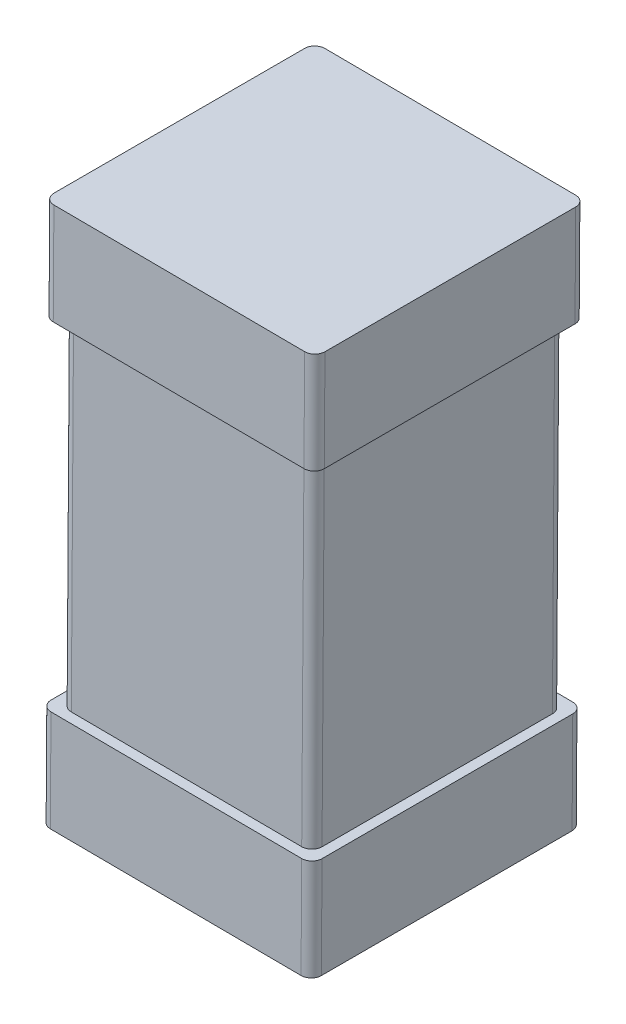
ISO-10303-21;
HEADER;
FILE_DESCRIPTION(('STEP AP214'),'2;1');
FILE_NAME('part.step','',(''),(''),'','','');
FILE_SCHEMA(('AUTOMOTIVE_DESIGN { 1 0 10303 214 1 1 1 1 }'));
ENDSEC;
DATA;
#1=APPLICATION_CONTEXT('core data for automotive mechanical design processes');
#2=APPLICATION_PROTOCOL_DEFINITION('international standard','automotive_design',2000,#1);
#3=PRODUCT_CONTEXT('',#1,'mechanical');
#4=PRODUCT('Part','Part','',(#3));
#5=PRODUCT_RELATED_PRODUCT_CATEGORY('part','',(#4));
#6=PRODUCT_DEFINITION_FORMATION('','',#4);
#7=PRODUCT_DEFINITION_CONTEXT('part definition',#1,'design');
#8=PRODUCT_DEFINITION('design','',#6,#7);
#9=PRODUCT_DEFINITION_SHAPE('','',#8);
#10=(LENGTH_UNIT() NAMED_UNIT(*) SI_UNIT(.MILLI.,.METRE.));
#11=(NAMED_UNIT(*) PLANE_ANGLE_UNIT() SI_UNIT($,.RADIAN.));
#12=(NAMED_UNIT(*) SI_UNIT($,.STERADIAN.) SOLID_ANGLE_UNIT());
#13=UNCERTAINTY_MEASURE_WITH_UNIT(LENGTH_MEASURE(1.E-05),#10,'distance_accuracy_value','');
#14=(GEOMETRIC_REPRESENTATION_CONTEXT(3) GLOBAL_UNCERTAINTY_ASSIGNED_CONTEXT((#13)) GLOBAL_UNIT_ASSIGNED_CONTEXT((#10,
#11,#12)) REPRESENTATION_CONTEXT('',''));
#15=CARTESIAN_POINT('',(0.,0.,0.));
#16=DIRECTION('',(0.,0.,1.));
#17=DIRECTION('',(1.,0.,0.));
#18=AXIS2_PLACEMENT_3D('',#15,#16,#17);
#19=CARTESIAN_POINT('',(194.689513142969,110.245792753851,142.211582908599));
#20=DIRECTION('',(0.00663069374923689,0.99997801670857,0.));
#21=DIRECTION('',(0.,0.,-1.));
#22=AXIS2_PLACEMENT_3D('',#19,#20,#21);
#23=PLANE('',#22);
#24=DIRECTION('',(0.,0.,1.));
#25=VECTOR('',#24,1.);
#26=CARTESIAN_POINT('',(194.689513142969,110.245792753851,142.211582908599));
#27=LINE('',#26,#25);
#28=CARTESIAN_POINT('',(194.689513142969,110.245792753851,142.241582908599));
#29=VERTEX_POINT('',#28);
#30=CARTESIAN_POINT('',(194.689513142969,110.245792753851,142.981582908599));
#31=VERTEX_POINT('',#30);
#32=EDGE_CURVE('E67',#29,#31,#27,.T.);
#33=ORIENTED_EDGE('',*,*,#32,.F.);
#34=CARTESIAN_POINT('',(194.659513802468,110.245991674664,142.241582908599));
#35=DIRECTION('',(0.00663069374923689,0.99997801670857,0.));
#36=DIRECTION('',(0.,0.,1.));
#37=AXIS2_PLACEMENT_3D('',#34,#35,#36);
#38=CIRCLE('',#37,0.0300000000000023);
#39=CARTESIAN_POINT('',(194.659513802468,110.245991674664,142.211582908599));
#40=VERTEX_POINT('',#39);
#41=EDGE_CURVE('E11',#29,#40,#38,.T.);
#42=ORIENTED_EDGE('',*,*,#41,.T.);
#43=DIRECTION('',(-0.999978016708569,0.00663069374923689,0.));
#44=VECTOR('',#43,1.);
#45=CARTESIAN_POINT('',(194.689513142969,110.245792753851,142.211582908599));
#46=LINE('',#45,#44);
#47=CARTESIAN_POINT('',(193.919530070103,110.250898388038,142.211582908599));
#48=VERTEX_POINT('',#47);
#49=EDGE_CURVE('E55',#40,#48,#46,.T.);
#50=ORIENTED_EDGE('',*,*,#49,.T.);
#51=CARTESIAN_POINT('',(193.919530070103,110.250898388038,142.241582908599));
#52=DIRECTION('',(-0.00663069374923689,-0.99997801670857,0.));
#53=DIRECTION('',(0.,0.,1.));
#54=AXIS2_PLACEMENT_3D('',#51,#52,#53);
#55=CIRCLE('',#54,0.0300000000000023);
#56=CARTESIAN_POINT('',(193.889530729602,110.251097308851,142.241582908599));
#57=VERTEX_POINT('',#56);
#58=EDGE_CURVE('E288',#57,#48,#55,.T.);
#59=ORIENTED_EDGE('',*,*,#58,.F.);
#60=DIRECTION('',(0.,0.,1.));
#61=VECTOR('',#60,1.);
#62=CARTESIAN_POINT('',(193.889530729602,110.251097308851,142.211582908599));
#63=LINE('',#62,#61);
#64=CARTESIAN_POINT('',(193.889530729602,110.251097308851,142.981582908599));
#65=VERTEX_POINT('',#64);
#66=EDGE_CURVE('E268',#57,#65,#63,.T.);
#67=ORIENTED_EDGE('',*,*,#66,.T.);
#68=CARTESIAN_POINT('',(193.919530070103,110.250898388038,142.981582908599));
#69=DIRECTION('',(0.00663069374923689,0.99997801670857,0.));
#70=DIRECTION('',(0.,0.,1.));
#71=AXIS2_PLACEMENT_3D('',#68,#69,#70);
#72=CIRCLE('',#71,0.0300000000000023);
#73=CARTESIAN_POINT('',(193.919530070103,110.250898388038,143.011582908599));
#74=VERTEX_POINT('',#73);
#75=EDGE_CURVE('E266',#65,#74,#72,.T.);
#76=ORIENTED_EDGE('',*,*,#75,.T.);
#77=DIRECTION('',(-0.999978016708569,0.00663069374923689,0.));
#78=VECTOR('',#77,1.);
#79=CARTESIAN_POINT('',(194.689513142969,110.245792753851,143.011582908599));
#80=LINE('',#79,#78);
#81=CARTESIAN_POINT('',(194.659513802468,110.245991674664,143.011582908599));
#82=VERTEX_POINT('',#81);
#83=EDGE_CURVE('E254',#82,#74,#80,.T.);
#84=ORIENTED_EDGE('',*,*,#83,.F.);
#85=CARTESIAN_POINT('',(194.659513802468,110.245991674664,142.981582908599));
#86=DIRECTION('',(-0.00663069374923689,-0.99997801670857,0.));
#87=DIRECTION('',(0.,0.,1.));
#88=AXIS2_PLACEMENT_3D('',#85,#86,#87);
#89=CIRCLE('',#88,0.0300000000000023);
#90=EDGE_CURVE('E336',#31,#82,#89,.T.);
#91=ORIENTED_EDGE('',*,*,#90,.F.);
#92=EDGE_LOOP('',(#33,#42,#50,#59,#67,#76,#84,#91));
#93=FACE_BOUND('',#92,.T.);
#94=ADVANCED_FACE('F44',(#93),#23,.T.);
#95=CARTESIAN_POINT('',(193.887541521477,109.951103903838,142.211582908599));
#96=DIRECTION('',(-0.99997801670857,0.00663069374923689,0.));
#97=DIRECTION('',(0.,0.,1.));
#98=AXIS2_PLACEMENT_3D('',#95,#96,#97);
#99=PLANE('',#98);
#100=ORIENTED_EDGE('',*,*,#66,.F.);
#101=DIRECTION('',(0.00663069374923689,0.999978016708569,0.));
#102=VECTOR('',#101,1.);
#103=CARTESIAN_POINT('',(193.887541521477,109.951103903838,142.241582908599));
#104=LINE('',#103,#102);
#105=CARTESIAN_POINT('',(193.887541521477,109.951103903838,142.241582908599));
#106=VERTEX_POINT('',#105);
#107=EDGE_CURVE('E279',#106,#57,#104,.T.);
#108=ORIENTED_EDGE('',*,*,#107,.F.);
#109=DIRECTION('',(0.,0.,1.));
#110=VECTOR('',#109,1.);
#111=CARTESIAN_POINT('',(193.887541521477,109.951103903838,142.211582908599));
#112=LINE('',#111,#110);
#113=CARTESIAN_POINT('',(193.887541521477,109.951103903838,142.981582908599));
#114=VERTEX_POINT('',#113);
#115=EDGE_CURVE('E272',#106,#114,#112,.T.);
#116=ORIENTED_EDGE('',*,*,#115,.T.);
#117=DIRECTION('',(0.00663069374923689,0.999978016708569,0.));
#118=VECTOR('',#117,1.);
#119=CARTESIAN_POINT('',(193.887541521477,109.951103903838,142.981582908599));
#120=LINE('',#119,#118);
#121=EDGE_CURVE('E284',#114,#65,#120,.T.);
#122=ORIENTED_EDGE('',*,*,#121,.T.);
#123=EDGE_LOOP('',(#100,#108,#116,#122));
#124=FACE_BOUND('',#123,.T.);
#125=ADVANCED_FACE('F567',(#124),#99,.T.);
#126=CARTESIAN_POINT('',(193.917540861979,109.950904983026,142.981582908599));
#127=DIRECTION('',(0.00663069374915559,0.99997801670857,0.));
#128=DIRECTION('',(-0.99997801670857,0.00663069374915559,0.));
#129=AXIS2_PLACEMENT_3D('',#126,#127,#128);
#130=CYLINDRICAL_SURFACE('',#129,0.0300000000000117);
#131=CARTESIAN_POINT('',(193.917540861979,109.950904983026,142.981582908599));
#132=DIRECTION('',(0.00663069374923689,0.99997801670857,0.));
#133=DIRECTION('',(0.,0.,1.));
#134=AXIS2_PLACEMENT_3D('',#131,#132,#133);
#135=CIRCLE('',#134,0.0300000000000023);
#136=CARTESIAN_POINT('',(193.917540861979,109.950904983026,143.011582908599));
#137=VERTEX_POINT('',#136);
#138=EDGE_CURVE('E276',#114,#137,#135,.T.);
#139=ORIENTED_EDGE('',*,*,#138,.T.);
#140=DIRECTION('',(0.00663069374923689,0.999978016708569,0.));
#141=VECTOR('',#140,1.);
#142=CARTESIAN_POINT('',(193.917540861979,109.950904983026,143.011582908599));
#143=LINE('',#142,#141);
#144=EDGE_CURVE('E258',#137,#74,#143,.T.);
#145=ORIENTED_EDGE('',*,*,#144,.T.);
#146=ORIENTED_EDGE('',*,*,#75,.F.);
#147=ORIENTED_EDGE('',*,*,#121,.F.);
#148=EDGE_LOOP('',(#139,#145,#146,#147));
#149=FACE_BOUND('',#148,.T.);
#150=ADVANCED_FACE('F274',(#149),#130,.T.);
#151=CARTESIAN_POINT('',(193.917540861979,109.950904983026,142.241582908599));
#152=DIRECTION('',(0.00663069374915559,0.99997801670857,0.));
#153=DIRECTION('',(-0.99997801670857,0.00663069374915559,0.));
#154=AXIS2_PLACEMENT_3D('',#151,#152,#153);
#155=CYLINDRICAL_SURFACE('',#154,0.0300000000000117);
#156=ORIENTED_EDGE('',*,*,#107,.T.);
#157=ORIENTED_EDGE('',*,*,#58,.T.);
#158=DIRECTION('',(0.00663069374923689,0.999978016708569,0.));
#159=VECTOR('',#158,1.);
#160=CARTESIAN_POINT('',(193.917540861979,109.950904983026,142.211582908599));
#161=LINE('',#160,#159);
#162=CARTESIAN_POINT('',(193.917540861979,109.950904983026,142.211582908599));
#163=VERTEX_POINT('',#162);
#164=EDGE_CURVE('E263',#163,#48,#161,.T.);
#165=ORIENTED_EDGE('',*,*,#164,.F.);
#166=CARTESIAN_POINT('',(193.917540861979,109.950904983026,142.241582908599));
#167=DIRECTION('',(-0.00663069374923689,-0.99997801670857,0.));
#168=DIRECTION('',(0.,0.,1.));
#169=AXIS2_PLACEMENT_3D('',#166,#167,#168);
#170=CIRCLE('',#169,0.0300000000000023);
#171=EDGE_CURVE('E298',#106,#163,#170,.T.);
#172=ORIENTED_EDGE('',*,*,#171,.F.);
#173=EDGE_LOOP('',(#156,#157,#165,#172));
#174=FACE_BOUND('',#173,.T.);
#175=ADVANCED_FACE('F580',(#174),#155,.T.);
#176=CARTESIAN_POINT('',(194.687523934844,109.945799348839,143.011582908599));
#177=DIRECTION('',(0.,0.,1.));
#178=DIRECTION('',(1.,0.,0.));
#179=AXIS2_PLACEMENT_3D('',#176,#177,#178);
#180=PLANE('',#179);
#181=DIRECTION('',(-0.999978016708569,0.00663069374923689,0.));
#182=VECTOR('',#181,1.);
#183=CARTESIAN_POINT('',(194.687523934844,109.945799348839,143.011582908599));
#184=LINE('',#183,#182);
#185=CARTESIAN_POINT('',(194.657524594343,109.945998269651,143.011582908599));
#186=VERTEX_POINT('',#185);
#187=EDGE_CURVE('E345',#186,#137,#184,.T.);
#188=ORIENTED_EDGE('',*,*,#187,.F.);
#189=DIRECTION('',(0.00663069374923689,0.999978016708569,0.));
#190=VECTOR('',#189,1.);
#191=CARTESIAN_POINT('',(194.657524594343,109.945998269651,143.011582908599));
#192=LINE('',#191,#190);
#193=EDGE_CURVE('E261',#186,#82,#192,.T.);
#194=ORIENTED_EDGE('',*,*,#193,.T.);
#195=ORIENTED_EDGE('',*,*,#83,.T.);
#196=ORIENTED_EDGE('',*,*,#144,.F.);
#197=EDGE_LOOP('',(#188,#194,#195,#196));
#198=FACE_BOUND('',#197,.T.);
#199=ADVANCED_FACE('F256',(#198),#180,.T.);
#200=CARTESIAN_POINT('',(194.687523934844,109.945799348839,142.211582908599));
#201=DIRECTION('',(0.,0.,1.));
#202=DIRECTION('',(1.,0.,0.));
#203=AXIS2_PLACEMENT_3D('',#200,#201,#202);
#204=PLANE('',#203);
#205=ORIENTED_EDGE('',*,*,#164,.T.);
#206=ORIENTED_EDGE('',*,*,#49,.F.);
#207=DIRECTION('',(0.00663069374923689,0.999978016708569,0.));
#208=VECTOR('',#207,1.);
#209=CARTESIAN_POINT('',(194.657524594343,109.945998269651,142.211582908599));
#210=LINE('',#209,#208);
#211=CARTESIAN_POINT('',(194.657524594343,109.945998269651,142.211582908599));
#212=VERTEX_POINT('',#211);
#213=EDGE_CURVE('E419',#212,#40,#210,.T.);
#214=ORIENTED_EDGE('',*,*,#213,.F.);
#215=DIRECTION('',(-0.999978016708569,0.00663069374923689,0.));
#216=VECTOR('',#215,1.);
#217=CARTESIAN_POINT('',(194.687523934844,109.945799348839,142.211582908599));
#218=LINE('',#217,#216);
#219=EDGE_CURVE('E423',#212,#163,#218,.T.);
#220=ORIENTED_EDGE('',*,*,#219,.T.);
#221=EDGE_LOOP('',(#205,#206,#214,#220));
#222=FACE_BOUND('',#221,.T.);
#223=ADVANCED_FACE('F584',(#222),#204,.F.);
#224=CARTESIAN_POINT('',(194.657524594343,109.945998269651,142.981582908599));
#225=DIRECTION('',(0.00663069374915559,0.99997801670857,0.));
#226=DIRECTION('',(0.99997801670857,-0.00663069374915559,0.));
#227=AXIS2_PLACEMENT_3D('',#224,#225,#226);
#228=CYLINDRICAL_SURFACE('',#227,0.0300000000000117);
#229=DIRECTION('',(0.00663069374923689,0.999978016708569,0.));
#230=VECTOR('',#229,1.);
#231=CARTESIAN_POINT('',(194.687523934844,109.945799348839,142.981582908599));
#232=LINE('',#231,#230);
#233=CARTESIAN_POINT('',(194.687523934844,109.945799348839,142.981582908599));
#234=VERTEX_POINT('',#233);
#235=EDGE_CURVE('E339',#234,#31,#232,.T.);
#236=ORIENTED_EDGE('',*,*,#235,.T.);
#237=ORIENTED_EDGE('',*,*,#90,.T.);
#238=ORIENTED_EDGE('',*,*,#193,.F.);
#239=CARTESIAN_POINT('',(194.657524594343,109.945998269651,142.981582908599));
#240=DIRECTION('',(-0.00663069374923689,-0.99997801670857,0.));
#241=DIRECTION('',(0.,0.,1.));
#242=AXIS2_PLACEMENT_3D('',#239,#240,#241);
#243=CIRCLE('',#242,0.0300000000000023);
#244=EDGE_CURVE('E341',#234,#186,#243,.T.);
#245=ORIENTED_EDGE('',*,*,#244,.F.);
#246=EDGE_LOOP('',(#236,#237,#238,#245));
#247=FACE_BOUND('',#246,.T.);
#248=ADVANCED_FACE('F587',(#247),#228,.T.);
#249=CARTESIAN_POINT('',(194.657524594343,109.945998269651,142.241582908599));
#250=DIRECTION('',(0.00663069374915559,0.99997801670857,0.));
#251=DIRECTION('',(0.99997801670857,-0.00663069374915559,0.));
#252=AXIS2_PLACEMENT_3D('',#249,#250,#251);
#253=CYLINDRICAL_SURFACE('',#252,0.0300000000000117);
#254=CARTESIAN_POINT('',(194.657524594343,109.945998269651,142.241582908599));
#255=DIRECTION('',(0.00663069374923689,0.99997801670857,0.));
#256=DIRECTION('',(0.,0.,1.));
#257=AXIS2_PLACEMENT_3D('',#254,#255,#256);
#258=CIRCLE('',#257,0.0300000000000023);
#259=CARTESIAN_POINT('',(194.687523934844,109.945799348839,142.241582908599));
#260=VERTEX_POINT('',#259);
#261=EDGE_CURVE('E340',#260,#212,#258,.T.);
#262=ORIENTED_EDGE('',*,*,#261,.T.);
#263=ORIENTED_EDGE('',*,*,#213,.T.);
#264=ORIENTED_EDGE('',*,*,#41,.F.);
#265=DIRECTION('',(0.00663069374923689,0.999978016708569,0.));
#266=VECTOR('',#265,1.);
#267=CARTESIAN_POINT('',(194.687523934844,109.945799348839,142.241582908599));
#268=LINE('',#267,#266);
#269=EDGE_CURVE('E436',#260,#29,#268,.T.);
#270=ORIENTED_EDGE('',*,*,#269,.F.);
#271=EDGE_LOOP('',(#262,#263,#264,#270));
#272=FACE_BOUND('',#271,.T.);
#273=ADVANCED_FACE('F649',(#272),#253,.T.);
#274=CARTESIAN_POINT('',(194.687523934844,109.945799348839,142.211582908599));
#275=DIRECTION('',(-0.99997801670857,0.00663069374923689,0.));
#276=DIRECTION('',(0.,0.,1.));
#277=AXIS2_PLACEMENT_3D('',#274,#275,#276);
#278=PLANE('',#277);
#279=ORIENTED_EDGE('',*,*,#235,.F.);
#280=DIRECTION('',(0.,0.,1.));
#281=VECTOR('',#280,1.);
#282=CARTESIAN_POINT('',(194.687523934844,109.945799348839,142.211582908599));
#283=LINE('',#282,#281);
#284=EDGE_CURVE('E294',#260,#234,#283,.T.);
#285=ORIENTED_EDGE('',*,*,#284,.F.);
#286=ORIENTED_EDGE('',*,*,#269,.T.);
#287=ORIENTED_EDGE('',*,*,#32,.T.);
#288=EDGE_LOOP('',(#279,#285,#286,#287));
#289=FACE_BOUND('',#288,.T.);
#290=ADVANCED_FACE('F652',(#289),#278,.F.);
#291=CARTESIAN_POINT('',(194.687523934844,109.945799348839,142.211582908599));
#292=DIRECTION('',(0.00663069374923689,0.99997801670857,0.));
#293=DIRECTION('',(0.,0.,-1.));
#294=AXIS2_PLACEMENT_3D('',#291,#292,#293);
#295=PLANE('',#294);
#296=ORIENTED_EDGE('',*,*,#244,.T.);
#297=ORIENTED_EDGE('',*,*,#187,.T.);
#298=ORIENTED_EDGE('',*,*,#138,.F.);
#299=ORIENTED_EDGE('',*,*,#115,.F.);
#300=ORIENTED_EDGE('',*,*,#171,.T.);
#301=ORIENTED_EDGE('',*,*,#219,.F.);
#302=ORIENTED_EDGE('',*,*,#261,.F.);
#303=ORIENTED_EDGE('',*,*,#284,.T.);
#304=EDGE_LOOP('',(#296,#297,#298,#299,#300,#301,#302,#303));
#305=FACE_BOUND('',#304,.T.);
#306=DIRECTION('',(-0.999978016708569,0.00663069374923689,0.));
#307=VECTOR('',#306,1.);
#308=CARTESIAN_POINT('',(194.657524594343,109.945998269651,142.241582908599));
#309=LINE('',#308,#307);
#310=CARTESIAN_POINT('',(194.627525253841,109.946197190464,142.241582908599));
#311=VERTEX_POINT('',#310);
#312=CARTESIAN_POINT('',(193.947540202479,109.950706062213,142.241582908599));
#313=VERTEX_POINT('',#312);
#314=EDGE_CURVE('E299',#311,#313,#309,.T.);
#315=ORIENTED_EDGE('',*,*,#314,.T.);
#316=CARTESIAN_POINT('',(193.947540202479,109.950706062213,142.271582908599));
#317=DIRECTION('',(-0.00663069374923689,-0.99997801670857,0.));
#318=DIRECTION('',(0.,0.,1.));
#319=AXIS2_PLACEMENT_3D('',#316,#317,#318);
#320=CIRCLE('',#319,0.0300000000000023);
#321=CARTESIAN_POINT('',(193.917540861979,109.950904983026,142.271582908599));
#322=VERTEX_POINT('',#321);
#323=EDGE_CURVE('E351',#322,#313,#320,.T.);
#324=ORIENTED_EDGE('',*,*,#323,.F.);
#325=DIRECTION('',(0.,0.,1.));
#326=VECTOR('',#325,1.);
#327=CARTESIAN_POINT('',(193.917540861979,109.950904983026,142.241582908599));
#328=LINE('',#327,#326);
#329=CARTESIAN_POINT('',(193.917540861979,109.950904983026,142.951582908599));
#330=VERTEX_POINT('',#329);
#331=EDGE_CURVE('E303',#322,#330,#328,.T.);
#332=ORIENTED_EDGE('',*,*,#331,.T.);
#333=CARTESIAN_POINT('',(193.947540202479,109.950706062213,142.951582908599));
#334=DIRECTION('',(0.00663069374923689,0.99997801670857,0.));
#335=DIRECTION('',(0.,0.,1.));
#336=AXIS2_PLACEMENT_3D('',#333,#334,#335);
#337=CIRCLE('',#336,0.0300000000000023);
#338=CARTESIAN_POINT('',(193.947540202479,109.950706062213,142.981582908599));
#339=VERTEX_POINT('',#338);
#340=EDGE_CURVE('E487',#330,#339,#337,.T.);
#341=ORIENTED_EDGE('',*,*,#340,.T.);
#342=DIRECTION('',(-0.999978016708569,0.00663069374923689,0.));
#343=VECTOR('',#342,1.);
#344=CARTESIAN_POINT('',(194.657524594343,109.945998269651,142.981582908599));
#345=LINE('',#344,#343);
#346=CARTESIAN_POINT('',(194.627525253841,109.946197190464,142.981582908599));
#347=VERTEX_POINT('',#346);
#348=EDGE_CURVE('E403',#347,#339,#345,.T.);
#349=ORIENTED_EDGE('',*,*,#348,.F.);
#350=CARTESIAN_POINT('',(194.627525253841,109.946197190464,142.951582908599));
#351=DIRECTION('',(-0.00663069374923689,-0.99997801670857,0.));
#352=DIRECTION('',(0.,0.,1.));
#353=AXIS2_PLACEMENT_3D('',#350,#351,#352);
#354=CIRCLE('',#353,0.0300000000000023);
#355=CARTESIAN_POINT('',(194.657524594343,109.945998269651,142.951582908599));
#356=VERTEX_POINT('',#355);
#357=EDGE_CURVE('E363',#356,#347,#354,.T.);
#358=ORIENTED_EDGE('',*,*,#357,.F.);
#359=DIRECTION('',(0.,0.,1.));
#360=VECTOR('',#359,1.);
#361=CARTESIAN_POINT('',(194.657524594343,109.945998269651,142.241582908599));
#362=LINE('',#361,#360);
#363=CARTESIAN_POINT('',(194.657524594343,109.945998269651,142.271582908599));
#364=VERTEX_POINT('',#363);
#365=EDGE_CURVE('E427',#364,#356,#362,.T.);
#366=ORIENTED_EDGE('',*,*,#365,.F.);
#367=CARTESIAN_POINT('',(194.627525253841,109.946197190464,142.271582908599));
#368=DIRECTION('',(0.00663069374923689,0.99997801670857,0.));
#369=DIRECTION('',(0.,0.,1.));
#370=AXIS2_PLACEMENT_3D('',#367,#368,#369);
#371=CIRCLE('',#370,0.0300000000000023);
#372=EDGE_CURVE('E48',#364,#311,#371,.T.);
#373=ORIENTED_EDGE('',*,*,#372,.T.);
#374=EDGE_LOOP('',(#315,#324,#332,#341,#349,#358,#366,#373));
#375=FACE_BOUND('',#374,.T.);
#376=ADVANCED_FACE('F545',(#305,#375),#295,.F.);
#377=CARTESIAN_POINT('',(194.650893900594,108.946020252943,142.241582908599));
#378=DIRECTION('',(-0.99997801670857,0.00663069374923689,0.));
#379=DIRECTION('',(0.,0.,1.));
#380=AXIS2_PLACEMENT_3D('',#377,#378,#379);
#381=PLANE('',#380);
#382=DIRECTION('',(0.00663069374923689,0.999978016708569,0.));
#383=VECTOR('',#382,1.);
#384=CARTESIAN_POINT('',(194.650893900594,108.946020252943,142.951582908599));
#385=LINE('',#384,#383);
#386=CARTESIAN_POINT('',(194.650893900594,108.946020252943,142.951582908599));
#387=VERTEX_POINT('',#386);
#388=EDGE_CURVE('E367',#387,#356,#385,.T.);
#389=ORIENTED_EDGE('',*,*,#388,.F.);
#390=DIRECTION('',(0.,0.,1.));
#391=VECTOR('',#390,1.);
#392=CARTESIAN_POINT('',(194.650893900594,108.946020252943,142.241582908599));
#393=LINE('',#392,#391);
#394=CARTESIAN_POINT('',(194.650893900594,108.946020252943,142.271582908599));
#395=VERTEX_POINT('',#394);
#396=EDGE_CURVE('E393',#395,#387,#393,.T.);
#397=ORIENTED_EDGE('',*,*,#396,.F.);
#398=DIRECTION('',(0.00663069374923689,0.999978016708569,0.));
#399=VECTOR('',#398,1.);
#400=CARTESIAN_POINT('',(194.650893900594,108.946020252943,142.271582908599));
#401=LINE('',#400,#399);
#402=EDGE_CURVE('E431',#395,#364,#401,.T.);
#403=ORIENTED_EDGE('',*,*,#402,.T.);
#404=ORIENTED_EDGE('',*,*,#365,.T.);
#405=EDGE_LOOP('',(#389,#397,#403,#404));
#406=FACE_BOUND('',#405,.T.);
#407=ADVANCED_FACE('F543',(#406),#381,.F.);
#408=CARTESIAN_POINT('',(194.620894560092,108.946219173755,142.951582908599));
#409=DIRECTION('',(0.00663069374915559,0.99997801670857,0.));
#410=DIRECTION('',(0.99997801670857,-0.00663069374915559,0.));
#411=AXIS2_PLACEMENT_3D('',#408,#409,#410);
#412=CYLINDRICAL_SURFACE('',#411,0.0300000000000117);
#413=ORIENTED_EDGE('',*,*,#388,.T.);
#414=ORIENTED_EDGE('',*,*,#357,.T.);
#415=DIRECTION('',(0.00663069374923689,0.999978016708569,0.));
#416=VECTOR('',#415,1.);
#417=CARTESIAN_POINT('',(194.620894560092,108.946219173755,142.981582908599));
#418=LINE('',#417,#416);
#419=CARTESIAN_POINT('',(194.620894560092,108.946219173755,142.981582908599));
#420=VERTEX_POINT('',#419);
#421=EDGE_CURVE('E368',#420,#347,#418,.T.);
#422=ORIENTED_EDGE('',*,*,#421,.F.);
#423=CARTESIAN_POINT('',(194.620894560092,108.946219173755,142.951582908599));
#424=DIRECTION('',(-0.00663069374923689,-0.99997801670857,0.));
#425=DIRECTION('',(0.,0.,1.));
#426=AXIS2_PLACEMENT_3D('',#423,#424,#425);
#427=CIRCLE('',#426,0.0300000000000023);
#428=EDGE_CURVE('E426',#387,#420,#427,.T.);
#429=ORIENTED_EDGE('',*,*,#428,.F.);
#430=EDGE_LOOP('',(#413,#414,#422,#429));
#431=FACE_BOUND('',#430,.T.);
#432=ADVANCED_FACE('F521',(#431),#412,.T.);
#433=CARTESIAN_POINT('',(194.650893900594,108.946020252943,142.981582908599));
#434=DIRECTION('',(0.,0.,1.));
#435=DIRECTION('',(1.,0.,0.));
#436=AXIS2_PLACEMENT_3D('',#433,#434,#435);
#437=PLANE('',#436);
#438=DIRECTION('',(-0.999978016708569,0.00663069374923689,0.));
#439=VECTOR('',#438,1.);
#440=CARTESIAN_POINT('',(194.650893900594,108.946020252943,142.981582908599));
#441=LINE('',#440,#439);
#442=CARTESIAN_POINT('',(193.94090950873,108.950728045505,142.981582908599));
#443=VERTEX_POINT('',#442);
#444=EDGE_CURVE('E445',#420,#443,#441,.T.);
#445=ORIENTED_EDGE('',*,*,#444,.F.);
#446=ORIENTED_EDGE('',*,*,#421,.T.);
#447=ORIENTED_EDGE('',*,*,#348,.T.);
#448=DIRECTION('',(0.00663069374923689,0.999978016708569,0.));
#449=VECTOR('',#448,1.);
#450=CARTESIAN_POINT('',(193.94090950873,108.950728045505,142.981582908599));
#451=LINE('',#450,#449);
#452=EDGE_CURVE('E304',#443,#339,#451,.T.);
#453=ORIENTED_EDGE('',*,*,#452,.F.);
#454=EDGE_LOOP('',(#445,#446,#447,#453));
#455=FACE_BOUND('',#454,.T.);
#456=ADVANCED_FACE('F523',(#455),#437,.T.);
#457=CARTESIAN_POINT('',(193.94090950873,108.950728045505,142.951582908599));
#458=DIRECTION('',(0.00663069374915559,0.99997801670857,0.));
#459=DIRECTION('',(-0.99997801670857,0.00663069374915559,0.));
#460=AXIS2_PLACEMENT_3D('',#457,#458,#459);
#461=CYLINDRICAL_SURFACE('',#460,0.0300000000000117);
#462=CARTESIAN_POINT('',(193.94090950873,108.950728045505,142.951582908599));
#463=DIRECTION('',(0.00663069374923689,0.99997801670857,0.));
#464=DIRECTION('',(0.,0.,1.));
#465=AXIS2_PLACEMENT_3D('',#462,#463,#464);
#466=CIRCLE('',#465,0.0300000000000023);
#467=CARTESIAN_POINT('',(193.910910168229,108.950926966317,142.951582908599));
#468=VERTEX_POINT('',#467);
#469=EDGE_CURVE('E308',#468,#443,#466,.T.);
#470=ORIENTED_EDGE('',*,*,#469,.T.);
#471=ORIENTED_EDGE('',*,*,#452,.T.);
#472=ORIENTED_EDGE('',*,*,#340,.F.);
#473=DIRECTION('',(0.00663069374923689,0.999978016708569,0.));
#474=VECTOR('',#473,1.);
#475=CARTESIAN_POINT('',(193.910910168229,108.950926966317,142.951582908599));
#476=LINE('',#475,#474);
#477=EDGE_CURVE('E350',#468,#330,#476,.T.);
#478=ORIENTED_EDGE('',*,*,#477,.F.);
#479=EDGE_LOOP('',(#470,#471,#472,#478));
#480=FACE_BOUND('',#479,.T.);
#481=ADVANCED_FACE('F525',(#480),#461,.T.);
#482=CARTESIAN_POINT('',(193.910910168229,108.950926966317,142.241582908599));
#483=DIRECTION('',(-0.99997801670857,0.00663069374923689,0.));
#484=DIRECTION('',(0.,0.,1.));
#485=AXIS2_PLACEMENT_3D('',#482,#483,#484);
#486=PLANE('',#485);
#487=ORIENTED_EDGE('',*,*,#331,.F.);
#488=DIRECTION('',(0.00663069374923689,0.999978016708569,0.));
#489=VECTOR('',#488,1.);
#490=CARTESIAN_POINT('',(193.910910168229,108.950926966317,142.271582908599));
#491=LINE('',#490,#489);
#492=CARTESIAN_POINT('',(193.910910168229,108.950926966317,142.271582908599));
#493=VERTEX_POINT('',#492);
#494=EDGE_CURVE('E346',#493,#322,#491,.T.);
#495=ORIENTED_EDGE('',*,*,#494,.F.);
#496=DIRECTION('',(0.,0.,1.));
#497=VECTOR('',#496,1.);
#498=CARTESIAN_POINT('',(193.910910168229,108.950926966317,142.241582908599));
#499=LINE('',#498,#497);
#500=EDGE_CURVE('E309',#493,#468,#499,.T.);
#501=ORIENTED_EDGE('',*,*,#500,.T.);
#502=ORIENTED_EDGE('',*,*,#477,.T.);
#503=EDGE_LOOP('',(#487,#495,#501,#502));
#504=FACE_BOUND('',#503,.T.);
#505=ADVANCED_FACE('F46',(#504),#486,.T.);
#506=CARTESIAN_POINT('',(193.94090950873,108.950728045505,142.271582908599));
#507=DIRECTION('',(0.00663069374915559,0.99997801670857,0.));
#508=DIRECTION('',(-0.99997801670857,0.00663069374915559,0.));
#509=AXIS2_PLACEMENT_3D('',#506,#507,#508);
#510=CYLINDRICAL_SURFACE('',#509,0.0300000000000117);
#511=ORIENTED_EDGE('',*,*,#494,.T.);
#512=ORIENTED_EDGE('',*,*,#323,.T.);
#513=DIRECTION('',(0.00663069374923689,0.999978016708569,0.));
#514=VECTOR('',#513,1.);
#515=CARTESIAN_POINT('',(193.94090950873,108.950728045505,142.241582908599));
#516=LINE('',#515,#514);
#517=CARTESIAN_POINT('',(193.94090950873,108.950728045505,142.241582908599));
#518=VERTEX_POINT('',#517);
#519=EDGE_CURVE('E330',#518,#313,#516,.T.);
#520=ORIENTED_EDGE('',*,*,#519,.F.);
#521=CARTESIAN_POINT('',(193.94090950873,108.950728045505,142.271582908599));
#522=DIRECTION('',(-0.00663069374923689,-0.99997801670857,0.));
#523=DIRECTION('',(0.,0.,1.));
#524=AXIS2_PLACEMENT_3D('',#521,#522,#523);
#525=CIRCLE('',#524,0.0300000000000023);
#526=EDGE_CURVE('E443',#493,#518,#525,.T.);
#527=ORIENTED_EDGE('',*,*,#526,.F.);
#528=EDGE_LOOP('',(#511,#512,#520,#527));
#529=FACE_BOUND('',#528,.T.);
#530=ADVANCED_FACE('F532',(#529),#510,.T.);
#531=CARTESIAN_POINT('',(194.650893900594,108.946020252943,142.241582908599));
#532=DIRECTION('',(0.,0.,1.));
#533=DIRECTION('',(1.,0.,0.));
#534=AXIS2_PLACEMENT_3D('',#531,#532,#533);
#535=PLANE('',#534);
#536=ORIENTED_EDGE('',*,*,#519,.T.);
#537=ORIENTED_EDGE('',*,*,#314,.F.);
#538=DIRECTION('',(0.00663069374923689,0.999978016708569,0.));
#539=VECTOR('',#538,1.);
#540=CARTESIAN_POINT('',(194.620894560092,108.946219173755,142.241582908599));
#541=LINE('',#540,#539);
#542=CARTESIAN_POINT('',(194.620894560092,108.946219173755,142.241582908599));
#543=VERTEX_POINT('',#542);
#544=EDGE_CURVE('E362',#543,#311,#541,.T.);
#545=ORIENTED_EDGE('',*,*,#544,.F.);
#546=DIRECTION('',(-0.999978016708569,0.00663069374923689,0.));
#547=VECTOR('',#546,1.);
#548=CARTESIAN_POINT('',(194.650893900594,108.946020252943,142.241582908599));
#549=LINE('',#548,#547);
#550=EDGE_CURVE('E327',#543,#518,#549,.T.);
#551=ORIENTED_EDGE('',*,*,#550,.T.);
#552=EDGE_LOOP('',(#536,#537,#545,#551));
#553=FACE_BOUND('',#552,.T.);
#554=ADVANCED_FACE('F555',(#553),#535,.F.);
#555=CARTESIAN_POINT('',(194.620894560092,108.946219173755,142.271582908599));
#556=DIRECTION('',(0.00663069374915559,0.99997801670857,0.));
#557=DIRECTION('',(0.99997801670857,-0.00663069374915559,0.));
#558=AXIS2_PLACEMENT_3D('',#555,#556,#557);
#559=CYLINDRICAL_SURFACE('',#558,0.0300000000000117);
#560=CARTESIAN_POINT('',(194.620894560092,108.946219173755,142.271582908599));
#561=DIRECTION('',(0.00663069374923689,0.99997801670857,0.));
#562=DIRECTION('',(0.,0.,1.));
#563=AXIS2_PLACEMENT_3D('',#560,#561,#562);
#564=CIRCLE('',#563,0.0300000000000023);
#565=EDGE_CURVE('E331',#395,#543,#564,.T.);
#566=ORIENTED_EDGE('',*,*,#565,.T.);
#567=ORIENTED_EDGE('',*,*,#544,.T.);
#568=ORIENTED_EDGE('',*,*,#372,.F.);
#569=ORIENTED_EDGE('',*,*,#402,.F.);
#570=EDGE_LOOP('',(#566,#567,#568,#569));
#571=FACE_BOUND('',#570,.T.);
#572=ADVANCED_FACE('F540',(#571),#559,.T.);
#573=CARTESIAN_POINT('',(194.680893241095,108.94582133213,142.211582908599));
#574=DIRECTION('',(0.00663069374923689,0.99997801670857,0.));
#575=DIRECTION('',(0.,0.,-1.));
#576=AXIS2_PLACEMENT_3D('',#573,#574,#575);
#577=PLANE('',#576);
#578=DIRECTION('',(0.,0.,1.));
#579=VECTOR('',#578,1.);
#580=CARTESIAN_POINT('',(194.680893241095,108.94582133213,142.211582908599));
#581=LINE('',#580,#579);
#582=CARTESIAN_POINT('',(194.680893241095,108.94582133213,142.241582908599));
#583=VERTEX_POINT('',#582);
#584=CARTESIAN_POINT('',(194.680893241095,108.94582133213,142.981582908599));
#585=VERTEX_POINT('',#584);
#586=EDGE_CURVE('E310',#583,#585,#581,.T.);
#587=ORIENTED_EDGE('',*,*,#586,.F.);
#588=CARTESIAN_POINT('',(194.650893900594,108.946020252943,142.241582908599));
#589=DIRECTION('',(0.00663069374923689,0.99997801670857,0.));
#590=DIRECTION('',(0.,0.,1.));
#591=AXIS2_PLACEMENT_3D('',#588,#589,#590);
#592=CIRCLE('',#591,0.0300000000000023);
#593=CARTESIAN_POINT('',(194.650893900594,108.946020252943,142.211582908599));
#594=VERTEX_POINT('',#593);
#595=EDGE_CURVE('E407',#583,#594,#592,.T.);
#596=ORIENTED_EDGE('',*,*,#595,.T.);
#597=DIRECTION('',(-0.999978016708569,0.00663069374923689,0.));
#598=VECTOR('',#597,1.);
#599=CARTESIAN_POINT('',(194.680893241095,108.94582133213,142.211582908599));
#600=LINE('',#599,#598);
#601=CARTESIAN_POINT('',(193.910910168229,108.950926966317,142.211582908599));
#602=VERTEX_POINT('',#601);
#603=EDGE_CURVE('E447',#594,#602,#600,.T.);
#604=ORIENTED_EDGE('',*,*,#603,.T.);
#605=CARTESIAN_POINT('',(193.910910168229,108.950926966317,142.241582908599));
#606=DIRECTION('',(-0.00663069374923689,-0.99997801670857,0.));
#607=DIRECTION('',(0.,0.,1.));
#608=AXIS2_PLACEMENT_3D('',#605,#606,#607);
#609=CIRCLE('',#608,0.0300000000000023);
#610=CARTESIAN_POINT('',(193.880910827728,108.95112588713,142.241582908599));
#611=VERTEX_POINT('',#610);
#612=EDGE_CURVE('E387',#611,#602,#609,.T.);
#613=ORIENTED_EDGE('',*,*,#612,.F.);
#614=DIRECTION('',(0.,0.,1.));
#615=VECTOR('',#614,1.);
#616=CARTESIAN_POINT('',(193.880910827728,108.95112588713,142.211582908599));
#617=LINE('',#616,#615);
#618=CARTESIAN_POINT('',(193.880910827728,108.95112588713,142.981582908599));
#619=VERTEX_POINT('',#618);
#620=EDGE_CURVE('E392',#611,#619,#617,.T.);
#621=ORIENTED_EDGE('',*,*,#620,.T.);
#622=CARTESIAN_POINT('',(193.910910168229,108.950926966317,142.981582908599));
#623=DIRECTION('',(0.00663069374923689,0.99997801670857,0.));
#624=DIRECTION('',(0.,0.,1.));
#625=AXIS2_PLACEMENT_3D('',#622,#623,#624);
#626=CIRCLE('',#625,0.0300000000000023);
#627=CARTESIAN_POINT('',(193.910910168229,108.950926966317,143.011582908599));
#628=VERTEX_POINT('',#627);
#629=EDGE_CURVE('E388',#619,#628,#626,.T.);
#630=ORIENTED_EDGE('',*,*,#629,.T.);
#631=DIRECTION('',(-0.999978016708569,0.00663069374923689,0.));
#632=VECTOR('',#631,1.);
#633=CARTESIAN_POINT('',(194.680893241095,108.94582133213,143.011582908599));
#634=LINE('',#633,#632);
#635=CARTESIAN_POINT('',(194.650893900594,108.946020252943,143.011582908599));
#636=VERTEX_POINT('',#635);
#637=EDGE_CURVE('E373',#636,#628,#634,.T.);
#638=ORIENTED_EDGE('',*,*,#637,.F.);
#639=CARTESIAN_POINT('',(194.650893900594,108.946020252943,142.981582908599));
#640=DIRECTION('',(-0.00663069374923689,-0.99997801670857,0.));
#641=DIRECTION('',(0.,0.,1.));
#642=AXIS2_PLACEMENT_3D('',#639,#640,#641);
#643=CIRCLE('',#642,0.0300000000000023);
#644=EDGE_CURVE('E319',#585,#636,#643,.T.);
#645=ORIENTED_EDGE('',*,*,#644,.F.);
#646=EDGE_LOOP('',(#587,#596,#604,#613,#621,#630,#638,#645));
#647=FACE_BOUND('',#646,.T.);
#648=ORIENTED_EDGE('',*,*,#565,.F.);
#649=ORIENTED_EDGE('',*,*,#396,.T.);
#650=ORIENTED_EDGE('',*,*,#428,.T.);
#651=ORIENTED_EDGE('',*,*,#444,.T.);
#652=ORIENTED_EDGE('',*,*,#469,.F.);
#653=ORIENTED_EDGE('',*,*,#500,.F.);
#654=ORIENTED_EDGE('',*,*,#526,.T.);
#655=ORIENTED_EDGE('',*,*,#550,.F.);
#656=EDGE_LOOP('',(#648,#649,#650,#651,#652,#653,#654,#655));
#657=FACE_BOUND('',#656,.T.);
#658=ADVANCED_FACE('F515',(#647,#657),#577,.T.);
#659=CARTESIAN_POINT('',(193.878921619603,108.651132482117,142.211582908599));
#660=DIRECTION('',(-0.99997801670857,0.00663069374923689,0.));
#661=DIRECTION('',(0.,0.,1.));
#662=AXIS2_PLACEMENT_3D('',#659,#660,#661);
#663=PLANE('',#662);
#664=ORIENTED_EDGE('',*,*,#620,.F.);
#665=DIRECTION('',(0.00663069374923689,0.999978016708569,0.));
#666=VECTOR('',#665,1.);
#667=CARTESIAN_POINT('',(193.878921619603,108.651132482117,142.241582908599));
#668=LINE('',#667,#666);
#669=CARTESIAN_POINT('',(193.878921619603,108.651132482117,142.241582908599));
#670=VERTEX_POINT('',#669);
#671=EDGE_CURVE('E291',#670,#611,#668,.T.);
#672=ORIENTED_EDGE('',*,*,#671,.F.);
#673=DIRECTION('',(0.,0.,1.));
#674=VECTOR('',#673,1.);
#675=CARTESIAN_POINT('',(193.878921619603,108.651132482117,142.211582908599));
#676=LINE('',#675,#674);
#677=CARTESIAN_POINT('',(193.878921619603,108.651132482117,142.981582908599));
#678=VERTEX_POINT('',#677);
#679=EDGE_CURVE('E415',#670,#678,#676,.T.);
#680=ORIENTED_EDGE('',*,*,#679,.T.);
#681=DIRECTION('',(0.00663069374923689,0.999978016708569,0.));
#682=VECTOR('',#681,1.);
#683=CARTESIAN_POINT('',(193.878921619603,108.651132482117,142.981582908599));
#684=LINE('',#683,#682);
#685=EDGE_CURVE('E324',#678,#619,#684,.T.);
#686=ORIENTED_EDGE('',*,*,#685,.T.);
#687=EDGE_LOOP('',(#664,#672,#680,#686));
#688=FACE_BOUND('',#687,.T.);
#689=ADVANCED_FACE('F575',(#688),#663,.T.);
#690=CARTESIAN_POINT('',(193.908920960104,108.650933561305,142.981582908599));
#691=DIRECTION('',(0.00663069374915559,0.99997801670857,0.));
#692=DIRECTION('',(-0.99997801670857,0.00663069374915559,0.));
#693=AXIS2_PLACEMENT_3D('',#690,#691,#692);
#694=CYLINDRICAL_SURFACE('',#693,0.0300000000000117);
#695=CARTESIAN_POINT('',(193.908920960104,108.650933561305,142.981582908599));
#696=DIRECTION('',(0.00663069374923689,0.99997801670857,0.));
#697=DIRECTION('',(0.,0.,1.));
#698=AXIS2_PLACEMENT_3D('',#695,#696,#697);
#699=CIRCLE('',#698,0.0300000000000023);
#700=CARTESIAN_POINT('',(193.908920960104,108.650933561305,143.011582908599));
#701=VERTEX_POINT('',#700);
#702=EDGE_CURVE('E321',#678,#701,#699,.T.);
#703=ORIENTED_EDGE('',*,*,#702,.T.);
#704=DIRECTION('',(0.00663069374923689,0.999978016708569,0.));
#705=VECTOR('',#704,1.);
#706=CARTESIAN_POINT('',(193.908920960104,108.650933561305,143.011582908599));
#707=LINE('',#706,#705);
#708=EDGE_CURVE('E325',#701,#628,#707,.T.);
#709=ORIENTED_EDGE('',*,*,#708,.T.);
#710=ORIENTED_EDGE('',*,*,#629,.F.);
#711=ORIENTED_EDGE('',*,*,#685,.F.);
#712=EDGE_LOOP('',(#703,#709,#710,#711));
#713=FACE_BOUND('',#712,.T.);
#714=ADVANCED_FACE('F591',(#713),#694,.T.);
#715=CARTESIAN_POINT('',(193.908920960104,108.650933561305,142.241582908599));
#716=DIRECTION('',(0.00663069374915559,0.99997801670857,0.));
#717=DIRECTION('',(-0.99997801670857,0.00663069374915559,0.));
#718=AXIS2_PLACEMENT_3D('',#715,#716,#717);
#719=CYLINDRICAL_SURFACE('',#718,0.0300000000000117);
#720=ORIENTED_EDGE('',*,*,#671,.T.);
#721=ORIENTED_EDGE('',*,*,#612,.T.);
#722=DIRECTION('',(0.00663069374923689,0.999978016708569,0.));
#723=VECTOR('',#722,1.);
#724=CARTESIAN_POINT('',(193.908920960104,108.650933561305,142.211582908599));
#725=LINE('',#724,#723);
#726=CARTESIAN_POINT('',(193.908920960104,108.650933561305,142.211582908599));
#727=VERTEX_POINT('',#726);
#728=EDGE_CURVE('E369',#727,#602,#725,.T.);
#729=ORIENTED_EDGE('',*,*,#728,.F.);
#730=CARTESIAN_POINT('',(193.908920960104,108.650933561305,142.241582908599));
#731=DIRECTION('',(-0.00663069374923689,-0.99997801670857,0.));
#732=DIRECTION('',(0.,0.,1.));
#733=AXIS2_PLACEMENT_3D('',#730,#731,#732);
#734=CIRCLE('',#733,0.0300000000000023);
#735=EDGE_CURVE('E378',#670,#727,#734,.T.);
#736=ORIENTED_EDGE('',*,*,#735,.F.);
#737=EDGE_LOOP('',(#720,#721,#729,#736));
#738=FACE_BOUND('',#737,.T.);
#739=ADVANCED_FACE('F625',(#738),#719,.T.);
#740=CARTESIAN_POINT('',(194.67890403297,108.645827927118,143.011582908599));
#741=DIRECTION('',(0.,0.,1.));
#742=DIRECTION('',(1.,0.,0.));
#743=AXIS2_PLACEMENT_3D('',#740,#741,#742);
#744=PLANE('',#743);
#745=DIRECTION('',(-0.999978016708569,0.00663069374923689,0.));
#746=VECTOR('',#745,1.);
#747=CARTESIAN_POINT('',(194.67890403297,108.645827927118,143.011582908599));
#748=LINE('',#747,#746);
#749=CARTESIAN_POINT('',(194.648904692469,108.64602684793,143.011582908599));
#750=VERTEX_POINT('',#749);
#751=EDGE_CURVE('E381',#750,#701,#748,.T.);
#752=ORIENTED_EDGE('',*,*,#751,.F.);
#753=DIRECTION('',(0.00663069374923689,0.999978016708569,0.));
#754=VECTOR('',#753,1.);
#755=CARTESIAN_POINT('',(194.648904692469,108.64602684793,143.011582908599));
#756=LINE('',#755,#754);
#757=EDGE_CURVE('E383',#750,#636,#756,.T.);
#758=ORIENTED_EDGE('',*,*,#757,.T.);
#759=ORIENTED_EDGE('',*,*,#637,.T.);
#760=ORIENTED_EDGE('',*,*,#708,.F.);
#761=EDGE_LOOP('',(#752,#758,#759,#760));
#762=FACE_BOUND('',#761,.T.);
#763=ADVANCED_FACE('F616',(#762),#744,.T.);
#764=CARTESIAN_POINT('',(194.67890403297,108.645827927118,142.211582908599));
#765=DIRECTION('',(0.,0.,1.));
#766=DIRECTION('',(1.,0.,0.));
#767=AXIS2_PLACEMENT_3D('',#764,#765,#766);
#768=PLANE('',#767);
#769=ORIENTED_EDGE('',*,*,#728,.T.);
#770=ORIENTED_EDGE('',*,*,#603,.F.);
#771=DIRECTION('',(0.00663069374923689,0.999978016708569,0.));
#772=VECTOR('',#771,1.);
#773=CARTESIAN_POINT('',(194.648904692469,108.64602684793,142.211582908599));
#774=LINE('',#773,#772);
#775=CARTESIAN_POINT('',(194.648904692469,108.64602684793,142.211582908599));
#776=VERTEX_POINT('',#775);
#777=EDGE_CURVE('E320',#776,#594,#774,.T.);
#778=ORIENTED_EDGE('',*,*,#777,.F.);
#779=DIRECTION('',(-0.999978016708569,0.00663069374923689,0.));
#780=VECTOR('',#779,1.);
#781=CARTESIAN_POINT('',(194.67890403297,108.645827927118,142.211582908599));
#782=LINE('',#781,#780);
#783=EDGE_CURVE('E374',#776,#727,#782,.T.);
#784=ORIENTED_EDGE('',*,*,#783,.T.);
#785=EDGE_LOOP('',(#769,#770,#778,#784));
#786=FACE_BOUND('',#785,.T.);
#787=ADVANCED_FACE('F631',(#786),#768,.F.);
#788=CARTESIAN_POINT('',(194.648904692469,108.64602684793,142.981582908599));
#789=DIRECTION('',(0.00663069374915559,0.99997801670857,0.));
#790=DIRECTION('',(0.99997801670857,-0.00663069374915559,0.));
#791=AXIS2_PLACEMENT_3D('',#788,#789,#790);
#792=CYLINDRICAL_SURFACE('',#791,0.0300000000000117);
#793=DIRECTION('',(0.00663069374923689,0.999978016708569,0.));
#794=VECTOR('',#793,1.);
#795=CARTESIAN_POINT('',(194.67890403297,108.645827927118,142.981582908599));
#796=LINE('',#795,#794);
#797=CARTESIAN_POINT('',(194.67890403297,108.645827927118,142.981582908599));
#798=VERTEX_POINT('',#797);
#799=EDGE_CURVE('E408',#798,#585,#796,.T.);
#800=ORIENTED_EDGE('',*,*,#799,.T.);
#801=ORIENTED_EDGE('',*,*,#644,.T.);
#802=ORIENTED_EDGE('',*,*,#757,.F.);
#803=CARTESIAN_POINT('',(194.648904692469,108.64602684793,142.981582908599));
#804=DIRECTION('',(-0.00663069374923689,-0.99997801670857,0.));
#805=DIRECTION('',(0.,0.,1.));
#806=AXIS2_PLACEMENT_3D('',#803,#804,#805);
#807=CIRCLE('',#806,0.0300000000000023);
#808=EDGE_CURVE('E314',#798,#750,#807,.T.);
#809=ORIENTED_EDGE('',*,*,#808,.F.);
#810=EDGE_LOOP('',(#800,#801,#802,#809));
#811=FACE_BOUND('',#810,.T.);
#812=ADVANCED_FACE('F610',(#811),#792,.T.);
#813=CARTESIAN_POINT('',(194.648904692469,108.64602684793,142.241582908599));
#814=DIRECTION('',(0.00663069374915559,0.99997801670857,0.));
#815=DIRECTION('',(0.99997801670857,-0.00663069374915559,0.));
#816=AXIS2_PLACEMENT_3D('',#813,#814,#815);
#817=CYLINDRICAL_SURFACE('',#816,0.0300000000000117);
#818=CARTESIAN_POINT('',(194.648904692469,108.64602684793,142.241582908599));
#819=DIRECTION('',(0.00663069374923689,0.99997801670857,0.));
#820=DIRECTION('',(0.,0.,1.));
#821=AXIS2_PLACEMENT_3D('',#818,#819,#820);
#822=CIRCLE('',#821,0.0300000000000023);
#823=CARTESIAN_POINT('',(194.67890403297,108.645827927118,142.241582908599));
#824=VERTEX_POINT('',#823);
#825=EDGE_CURVE('E315',#824,#776,#822,.T.);
#826=ORIENTED_EDGE('',*,*,#825,.T.);
#827=ORIENTED_EDGE('',*,*,#777,.T.);
#828=ORIENTED_EDGE('',*,*,#595,.F.);
#829=DIRECTION('',(0.00663069374923689,0.999978016708569,0.));
#830=VECTOR('',#829,1.);
#831=CARTESIAN_POINT('',(194.67890403297,108.645827927118,142.241582908599));
#832=LINE('',#831,#830);
#833=EDGE_CURVE('E313',#824,#583,#832,.T.);
#834=ORIENTED_EDGE('',*,*,#833,.F.);
#835=EDGE_LOOP('',(#826,#827,#828,#834));
#836=FACE_BOUND('',#835,.T.);
#837=ADVANCED_FACE('F597',(#836),#817,.T.);
#838=CARTESIAN_POINT('',(194.67890403297,108.645827927118,142.211582908599));
#839=DIRECTION('',(-0.99997801670857,0.00663069374923689,0.));
#840=DIRECTION('',(0.,0.,1.));
#841=AXIS2_PLACEMENT_3D('',#838,#839,#840);
#842=PLANE('',#841);
#843=ORIENTED_EDGE('',*,*,#799,.F.);
#844=DIRECTION('',(0.,0.,1.));
#845=VECTOR('',#844,1.);
#846=CARTESIAN_POINT('',(194.67890403297,108.645827927118,142.211582908599));
#847=LINE('',#846,#845);
#848=EDGE_CURVE('E382',#824,#798,#847,.T.);
#849=ORIENTED_EDGE('',*,*,#848,.F.);
#850=ORIENTED_EDGE('',*,*,#833,.T.);
#851=ORIENTED_EDGE('',*,*,#586,.T.);
#852=EDGE_LOOP('',(#843,#849,#850,#851));
#853=FACE_BOUND('',#852,.T.);
#854=ADVANCED_FACE('F593',(#853),#842,.F.);
#855=CARTESIAN_POINT('',(194.67890403297,108.645827927118,142.211582908599));
#856=DIRECTION('',(0.00663069374923689,0.99997801670857,0.));
#857=DIRECTION('',(0.,0.,-1.));
#858=AXIS2_PLACEMENT_3D('',#855,#856,#857);
#859=PLANE('',#858);
#860=ORIENTED_EDGE('',*,*,#808,.T.);
#861=ORIENTED_EDGE('',*,*,#751,.T.);
#862=ORIENTED_EDGE('',*,*,#702,.F.);
#863=ORIENTED_EDGE('',*,*,#679,.F.);
#864=ORIENTED_EDGE('',*,*,#735,.T.);
#865=ORIENTED_EDGE('',*,*,#783,.F.);
#866=ORIENTED_EDGE('',*,*,#825,.F.);
#867=ORIENTED_EDGE('',*,*,#848,.T.);
#868=EDGE_LOOP('',(#860,#861,#862,#863,#864,#865,#866,#867));
#869=FACE_BOUND('',#868,.T.);
#870=ADVANCED_FACE('F596',(#869),#859,.F.);
#871=CLOSED_SHELL('',(#94,#125,#150,#175,#199,#223,#248,#273,#290,#376,#407,#432,#456,#481,#505,
#530,#554,#572,#658,#689,#714,#739,#763,#787,#812,#837,#854,#870));
#872=MANIFOLD_SOLID_BREP('B2',#871);
#873=ADVANCED_BREP_SHAPE_REPRESENTATION('',(#18,#872),#14);
#874=SHAPE_DEFINITION_REPRESENTATION(#9,#873);
ENDSEC;
END-ISO-10303-21;
